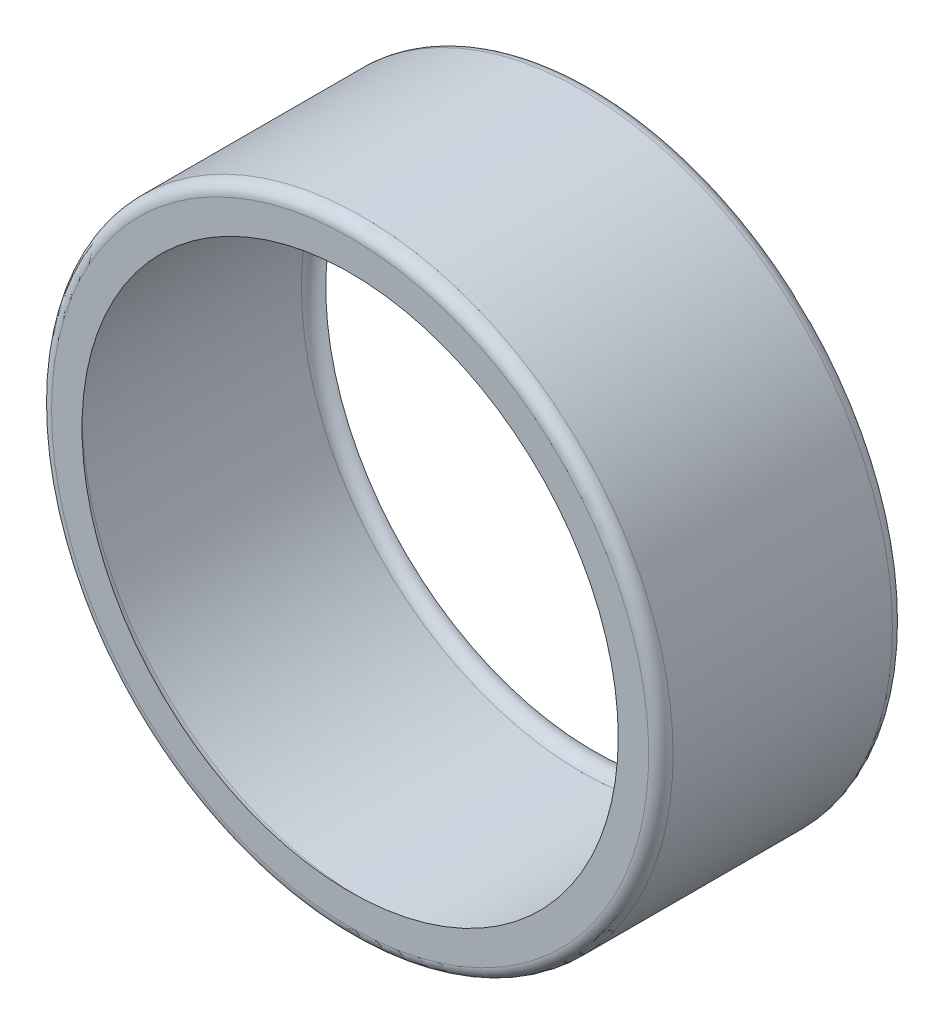
ISO-10303-21;
HEADER;
FILE_DESCRIPTION(('STEP AP214'),'2;1');
FILE_NAME('part.step','',(''),(''),'','','');
FILE_SCHEMA(('AUTOMOTIVE_DESIGN { 1 0 10303 214 1 1 1 1 }'));
ENDSEC;
DATA;
#1=APPLICATION_CONTEXT('core data for automotive mechanical design processes');
#2=APPLICATION_PROTOCOL_DEFINITION('international standard','automotive_design',2000,#1);
#3=PRODUCT_CONTEXT('',#1,'mechanical');
#4=PRODUCT('Part','Part','',(#3));
#5=PRODUCT_RELATED_PRODUCT_CATEGORY('part','',(#4));
#6=PRODUCT_DEFINITION_FORMATION('','',#4);
#7=PRODUCT_DEFINITION_CONTEXT('part definition',#1,'design');
#8=PRODUCT_DEFINITION('design','',#6,#7);
#9=PRODUCT_DEFINITION_SHAPE('','',#8);
#10=(LENGTH_UNIT() NAMED_UNIT(*) SI_UNIT(.MILLI.,.METRE.));
#11=(NAMED_UNIT(*) PLANE_ANGLE_UNIT() SI_UNIT($,.RADIAN.));
#12=(NAMED_UNIT(*) SI_UNIT($,.STERADIAN.) SOLID_ANGLE_UNIT());
#13=UNCERTAINTY_MEASURE_WITH_UNIT(LENGTH_MEASURE(1.E-05),#10,'distance_accuracy_value','');
#14=(GEOMETRIC_REPRESENTATION_CONTEXT(3) GLOBAL_UNCERTAINTY_ASSIGNED_CONTEXT((#13)) GLOBAL_UNIT_ASSIGNED_CONTEXT((#10,
#11,#12)) REPRESENTATION_CONTEXT('',''));
#15=CARTESIAN_POINT('',(0.,0.,0.));
#16=DIRECTION('',(0.,0.,1.));
#17=DIRECTION('',(1.,0.,0.));
#18=AXIS2_PLACEMENT_3D('',#15,#16,#17);
#19=CARTESIAN_POINT('',(0.,0.,-1.27));
#20=DIRECTION('',(0.,0.,1.));
#21=DIRECTION('',(1.,0.,0.));
#22=AXIS2_PLACEMENT_3D('',#19,#20,#21);
#23=TOROIDAL_SURFACE('',#22,27.94,1.27);
#24=CARTESIAN_POINT('',(0.,0.,-1.27));
#25=DIRECTION('',(0.,0.,1.));
#26=DIRECTION('',(1.,0.,0.));
#27=AXIS2_PLACEMENT_3D('',#24,#25,#26);
#28=CIRCLE('',#27,29.21);
#29=CARTESIAN_POINT('',(29.21,0.,-1.27));
#30=VERTEX_POINT('',#29);
#31=EDGE_CURVE('E60',#30,#30,#28,.T.);
#32=ORIENTED_EDGE('',*,*,#31,.F.);
#33=EDGE_LOOP('',(#32));
#34=FACE_BOUND('',#33,.T.);
#35=CARTESIAN_POINT('',(0.,0.,0.));
#36=DIRECTION('',(0.,0.,1.));
#37=DIRECTION('',(1.,0.,0.));
#38=AXIS2_PLACEMENT_3D('',#35,#36,#37);
#39=CIRCLE('',#38,27.94);
#40=CARTESIAN_POINT('',(27.94,0.,0.));
#41=VERTEX_POINT('',#40);
#42=EDGE_CURVE('E51',#41,#41,#39,.T.);
#43=ORIENTED_EDGE('',*,*,#42,.T.);
#44=EDGE_LOOP('',(#43));
#45=FACE_BOUND('',#44,.T.);
#46=ADVANCED_FACE('F31',(#34,#45),#23,.F.);
#47=CARTESIAN_POINT('',(0.,27.94,0.));
#48=DIRECTION('',(0.,0.,-1.));
#49=DIRECTION('',(-1.,0.,0.));
#50=AXIS2_PLACEMENT_3D('',#47,#48,#49);
#51=PLANE('',#50);
#52=CARTESIAN_POINT('',(0.,0.,0.));
#53=DIRECTION('',(0.,0.,-1.));
#54=DIRECTION('',(-1.,0.,0.));
#55=AXIS2_PLACEMENT_3D('',#52,#53,#54);
#56=CIRCLE('',#55,31.115);
#57=CARTESIAN_POINT('',(-31.115,0.,0.));
#58=VERTEX_POINT('',#57);
#59=EDGE_CURVE('E10',#58,#58,#56,.F.);
#60=ORIENTED_EDGE('',*,*,#59,.T.);
#61=EDGE_LOOP('',(#60));
#62=FACE_BOUND('',#61,.T.);
#63=ORIENTED_EDGE('',*,*,#42,.F.);
#64=EDGE_LOOP('',(#63));
#65=FACE_BOUND('',#64,.T.);
#66=ADVANCED_FACE('F68',(#62,#65),#51,.F.);
#67=CARTESIAN_POINT('',(0.,0.,0.));
#68=DIRECTION('',(0.,0.,1.));
#69=DIRECTION('',(1.,0.,0.));
#70=AXIS2_PLACEMENT_3D('',#67,#68,#69);
#71=CYLINDRICAL_SURFACE('',#70,32.385);
#72=CARTESIAN_POINT('',(0.,0.,-24.13));
#73=DIRECTION('',(0.,0.,1.));
#74=DIRECTION('',(1.,0.,0.));
#75=AXIS2_PLACEMENT_3D('',#72,#73,#74);
#76=CIRCLE('',#75,32.385);
#77=CARTESIAN_POINT('',(32.385,0.,-24.13));
#78=VERTEX_POINT('',#77);
#79=EDGE_CURVE('E42',#78,#78,#76,.T.);
#80=ORIENTED_EDGE('',*,*,#79,.T.);
#81=EDGE_LOOP('',(#80));
#82=FACE_BOUND('',#81,.T.);
#83=CARTESIAN_POINT('',(0.,0.,-1.27));
#84=DIRECTION('',(0.,0.,-1.));
#85=DIRECTION('',(-1.,0.,0.));
#86=AXIS2_PLACEMENT_3D('',#83,#84,#85);
#87=CIRCLE('',#86,32.385);
#88=CARTESIAN_POINT('',(-32.385,0.,-1.27));
#89=VERTEX_POINT('',#88);
#90=EDGE_CURVE('E46',#89,#89,#87,.T.);
#91=ORIENTED_EDGE('',*,*,#90,.T.);
#92=EDGE_LOOP('',(#91));
#93=FACE_BOUND('',#92,.T.);
#94=ADVANCED_FACE('F73',(#82,#93),#71,.T.);
#95=CARTESIAN_POINT('',(0.,32.385,-25.4));
#96=DIRECTION('',(0.,0.,1.));
#97=DIRECTION('',(1.,0.,0.));
#98=AXIS2_PLACEMENT_3D('',#95,#96,#97);
#99=PLANE('',#98);
#100=CARTESIAN_POINT('',(0.,0.,-25.4));
#101=DIRECTION('',(0.,0.,1.));
#102=DIRECTION('',(1.,0.,0.));
#103=AXIS2_PLACEMENT_3D('',#100,#101,#102);
#104=CIRCLE('',#103,31.115);
#105=CARTESIAN_POINT('',(31.115,0.,-25.4));
#106=VERTEX_POINT('',#105);
#107=EDGE_CURVE('E38',#106,#106,#104,.F.);
#108=ORIENTED_EDGE('',*,*,#107,.T.);
#109=EDGE_LOOP('',(#108));
#110=FACE_BOUND('',#109,.T.);
#111=CARTESIAN_POINT('',(0.,0.,-25.4));
#112=DIRECTION('',(0.,0.,1.));
#113=DIRECTION('',(1.,0.,0.));
#114=AXIS2_PLACEMENT_3D('',#111,#112,#113);
#115=CIRCLE('',#114,27.94);
#116=CARTESIAN_POINT('',(27.94,0.,-25.4));
#117=VERTEX_POINT('',#116);
#118=EDGE_CURVE('E54',#117,#117,#115,.T.);
#119=ORIENTED_EDGE('',*,*,#118,.T.);
#120=EDGE_LOOP('',(#119));
#121=FACE_BOUND('',#120,.T.);
#122=ADVANCED_FACE('F78',(#110,#121),#99,.F.);
#123=CARTESIAN_POINT('',(0.,0.,-24.13));
#124=DIRECTION('',(0.,0.,1.));
#125=DIRECTION('',(1.,0.,0.));
#126=AXIS2_PLACEMENT_3D('',#123,#124,#125);
#127=TOROIDAL_SURFACE('',#126,27.94,1.27);
#128=ORIENTED_EDGE('',*,*,#118,.F.);
#129=EDGE_LOOP('',(#128));
#130=FACE_BOUND('',#129,.T.);
#131=CARTESIAN_POINT('',(0.,0.,-24.13));
#132=DIRECTION('',(0.,0.,1.));
#133=DIRECTION('',(1.,0.,0.));
#134=AXIS2_PLACEMENT_3D('',#131,#132,#133);
#135=CIRCLE('',#134,29.21);
#136=CARTESIAN_POINT('',(29.21,0.,-24.13));
#137=VERTEX_POINT('',#136);
#138=EDGE_CURVE('E57',#137,#137,#135,.T.);
#139=ORIENTED_EDGE('',*,*,#138,.T.);
#140=EDGE_LOOP('',(#139));
#141=FACE_BOUND('',#140,.T.);
#142=ADVANCED_FACE('F90',(#130,#141),#127,.F.);
#143=CARTESIAN_POINT('',(0.,0.,0.));
#144=DIRECTION('',(0.,0.,1.));
#145=DIRECTION('',(1.,0.,0.));
#146=AXIS2_PLACEMENT_3D('',#143,#144,#145);
#147=CYLINDRICAL_SURFACE('',#146,29.21);
#148=ORIENTED_EDGE('',*,*,#138,.F.);
#149=EDGE_LOOP('',(#148));
#150=FACE_BOUND('',#149,.T.);
#151=ORIENTED_EDGE('',*,*,#31,.T.);
#152=EDGE_LOOP('',(#151));
#153=FACE_BOUND('',#152,.T.);
#154=ADVANCED_FACE('F64',(#150,#153),#147,.F.);
#155=CARTESIAN_POINT('',(0.,0.,-24.13));
#156=DIRECTION('',(0.,0.,1.));
#157=DIRECTION('',(1.,0.,0.));
#158=AXIS2_PLACEMENT_3D('',#155,#156,#157);
#159=TOROIDAL_SURFACE('',#158,31.115,1.27);
#160=ORIENTED_EDGE('',*,*,#107,.F.);
#161=EDGE_LOOP('',(#160));
#162=FACE_BOUND('',#161,.T.);
#163=ORIENTED_EDGE('',*,*,#79,.F.);
#164=EDGE_LOOP('',(#163));
#165=FACE_BOUND('',#164,.T.);
#166=ADVANCED_FACE('F82',(#162,#165),#159,.T.);
#167=CARTESIAN_POINT('',(0.,0.,-1.27));
#168=DIRECTION('',(0.,0.,-1.));
#169=DIRECTION('',(-1.,0.,0.));
#170=AXIS2_PLACEMENT_3D('',#167,#168,#169);
#171=TOROIDAL_SURFACE('',#170,31.115,1.27);
#172=ORIENTED_EDGE('',*,*,#90,.F.);
#173=EDGE_LOOP('',(#172));
#174=FACE_BOUND('',#173,.T.);
#175=ORIENTED_EDGE('',*,*,#59,.F.);
#176=EDGE_LOOP('',(#175));
#177=FACE_BOUND('',#176,.T.);
#178=ADVANCED_FACE('F33',(#174,#177),#171,.T.);
#179=CLOSED_SHELL('',(#46,#66,#94,#122,#142,#154,#166,#178));
#180=MANIFOLD_SOLID_BREP('B2',#179);
#181=ADVANCED_BREP_SHAPE_REPRESENTATION('',(#18,#180),#14);
#182=SHAPE_DEFINITION_REPRESENTATION(#9,#181);
ENDSEC;
END-ISO-10303-21;
